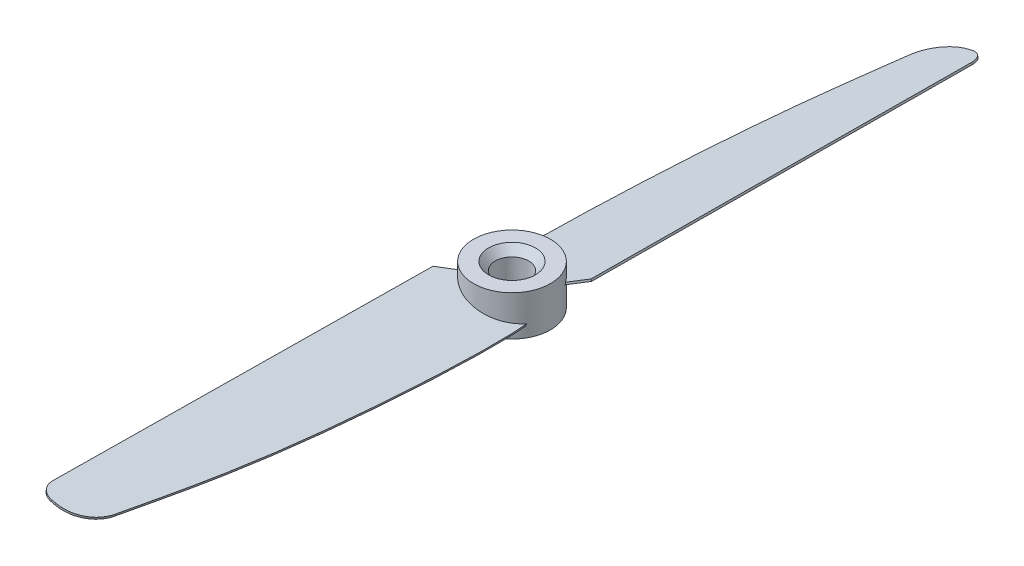
ISO-10303-21;
HEADER;
FILE_DESCRIPTION(('STEP AP214'),'2;1');
FILE_NAME('part.step','',(''),(''),'','','');
FILE_SCHEMA(('AUTOMOTIVE_DESIGN { 1 0 10303 214 1 1 1 1 }'));
ENDSEC;
DATA;
#1=APPLICATION_CONTEXT('core data for automotive mechanical design processes');
#2=APPLICATION_PROTOCOL_DEFINITION('international standard','automotive_design',2000,#1);
#3=PRODUCT_CONTEXT('',#1,'mechanical');
#4=PRODUCT('Part','Part','',(#3));
#5=PRODUCT_RELATED_PRODUCT_CATEGORY('part','',(#4));
#6=PRODUCT_DEFINITION_FORMATION('','',#4);
#7=PRODUCT_DEFINITION_CONTEXT('part definition',#1,'design');
#8=PRODUCT_DEFINITION('design','',#6,#7);
#9=PRODUCT_DEFINITION_SHAPE('','',#8);
#10=(LENGTH_UNIT() NAMED_UNIT(*) SI_UNIT(.MILLI.,.METRE.));
#11=(NAMED_UNIT(*) PLANE_ANGLE_UNIT() SI_UNIT($,.RADIAN.));
#12=(NAMED_UNIT(*) SI_UNIT($,.STERADIAN.) SOLID_ANGLE_UNIT());
#13=UNCERTAINTY_MEASURE_WITH_UNIT(LENGTH_MEASURE(1.E-05),#10,'distance_accuracy_value','');
#14=(GEOMETRIC_REPRESENTATION_CONTEXT(3) GLOBAL_UNCERTAINTY_ASSIGNED_CONTEXT((#13)) GLOBAL_UNIT_ASSIGNED_CONTEXT((#10,
#11,#12)) REPRESENTATION_CONTEXT('',''));
#15=CARTESIAN_POINT('',(0.,0.,0.));
#16=DIRECTION('',(0.,0.,1.));
#17=DIRECTION('',(1.,0.,0.));
#18=AXIS2_PLACEMENT_3D('',#15,#16,#17);
#19=CARTESIAN_POINT('',(0.,3.,0.));
#20=DIRECTION('',(0.,-1.,0.));
#21=DIRECTION('',(0.,0.,-1.));
#22=AXIS2_PLACEMENT_3D('',#19,#20,#21);
#23=CYLINDRICAL_SURFACE('',#22,5.75);
#24=CARTESIAN_POINT('',(-4.95193570611491,-1.45113567137876,-2.92247031849739));
#25=CARTESIAN_POINT('',(-4.961704972205,-1.40198803813977,-2.90592037355739));
#26=CARTESIAN_POINT('',(-4.97143265278503,-1.35287472444937,-2.88924618076763));
#27=CARTESIAN_POINT('',(-4.99080484292502,-1.2547167361658,-2.85564929948861));
#28=CARTESIAN_POINT('',(-5.00044935248497,-1.20567206157261,-2.83872661099934));
#29=CARTESIAN_POINT('',(-5.01005227653487,-1.15666170652803,-2.82167967466032));
#30=B_SPLINE_CURVE_WITH_KNOTS('',3,(#24,#25,#26,#27,#28,#29),.UNSPECIFIED.,.F.,.F.,(4,2,4),(0.,
0.158312875366385,0.31662575073277),.UNSPECIFIED.);
#31=CARTESIAN_POINT('',(-4.95193570611491,-1.45113567137876,-2.92247031849739));
#32=VERTEX_POINT('',#31);
#33=CARTESIAN_POINT('',(-5.01005227653471,-1.15666170652808,-2.82167967466));
#34=VERTEX_POINT('',#33);
#35=EDGE_CURVE('E51',#32,#34,#30,.T.);
#36=ORIENTED_EDGE('',*,*,#35,.F.);
#37=CARTESIAN_POINT('',(0.,-0.307891232338018,0.));
#38=DIRECTION('',(0.224951054343866,-0.974370064785235,0.));
#39=DIRECTION('',(-0.974370064785235,-0.224951054343866,0.));
#40=AXIS2_PLACEMENT_3D('',#37,#38,#39);
#41=ELLIPSE('',#40,5.901248619812,5.75);
#42=CARTESIAN_POINT('',(4.81718823206069,0.804244301109185,-3.13961741887384));
#43=VERTEX_POINT('',#42);
#44=EDGE_CURVE('E55',#32,#43,#41,.T.);
#45=ORIENTED_EDGE('',*,*,#44,.T.);
#46=CARTESIAN_POINT('',(0.,7.08301748882909,0.));
#47=DIRECTION('',(0.673615954099516,0.155516496836276,0.722534542838176));
#48=DIRECTION('',(0.106048656081873,-0.987833295253694,0.113750003654752));
#49=AXIS2_PLACEMENT_3D('',#46,#47,#48);
#50=ELLIPSE('',#49,36.9735694731695,5.75);
#51=CARTESIAN_POINT('',(4.79070517512482,1.10602143799694,-3.17988111806594));
#52=VERTEX_POINT('',#51);
#53=EDGE_CURVE('E248',#43,#52,#50,.T.);
#54=ORIENTED_EDGE('',*,*,#53,.T.);
#55=CARTESIAN_POINT('',(0.,0.,0.));
#56=DIRECTION('',(0.224951054343866,-0.974370064785235,0.));
#57=DIRECTION('',(-0.974370064785235,-0.224951054343866,0.));
#58=AXIS2_PLACEMENT_3D('',#55,#56,#57);
#59=ELLIPSE('',#58,5.901248619812,5.75);
#60=EDGE_CURVE('E349',#34,#52,#59,.T.);
#61=ORIENTED_EDGE('',*,*,#60,.F.);
#62=EDGE_LOOP('',(#36,#45,#54,#61));
#63=FACE_BOUND('',#62,.T.);
#64=CARTESIAN_POINT('',(4.95193570611491,-1.45113567137876,2.92247031849739));
#65=CARTESIAN_POINT('',(4.961704972205,-1.40198803813977,2.90592037355739));
#66=CARTESIAN_POINT('',(4.97143265278503,-1.35287472444937,2.88924618076763));
#67=CARTESIAN_POINT('',(4.99080484292502,-1.2547167361658,2.85564929948861));
#68=CARTESIAN_POINT('',(5.00044935248497,-1.20567206157261,2.83872661099934));
#69=CARTESIAN_POINT('',(5.01005227653487,-1.15666170652803,2.82167967466032));
#70=B_SPLINE_CURVE_WITH_KNOTS('',3,(#64,#65,#66,#67,#68,#69),.UNSPECIFIED.,.F.,.F.,(4,2,4),(0.,
0.158312875366385,0.31662575073277),.UNSPECIFIED.);
#71=CARTESIAN_POINT('',(4.95193570611491,-1.45113567137876,2.92247031849739));
#72=VERTEX_POINT('',#71);
#73=CARTESIAN_POINT('',(5.01005227653471,-1.15666170652808,2.82167967466));
#74=VERTEX_POINT('',#73);
#75=EDGE_CURVE('E223',#72,#74,#70,.T.);
#76=ORIENTED_EDGE('',*,*,#75,.F.);
#77=CARTESIAN_POINT('',(0.,-0.307891232338018,0.));
#78=DIRECTION('',(-0.224951054343866,-0.974370064785235,0.));
#79=DIRECTION('',(0.974370064785235,-0.224951054343866,0.));
#80=AXIS2_PLACEMENT_3D('',#77,#78,#79);
#81=ELLIPSE('',#80,5.901248619812,5.75);
#82=CARTESIAN_POINT('',(-4.81718823206069,0.804244301109185,3.13961741887384));
#83=VERTEX_POINT('',#82);
#84=EDGE_CURVE('E232',#72,#83,#81,.T.);
#85=ORIENTED_EDGE('',*,*,#84,.T.);
#86=CARTESIAN_POINT('',(0.,7.08301748882909,0.));
#87=DIRECTION('',(-0.673615954099516,0.155516496836276,-0.722534542838176));
#88=DIRECTION('',(-0.106048656081873,-0.987833295253694,-0.113750003654752));
#89=AXIS2_PLACEMENT_3D('',#86,#87,#88);
#90=ELLIPSE('',#89,36.9735694731695,5.75);
#91=CARTESIAN_POINT('',(-4.79070517512482,1.10602143799694,3.17988111806594));
#92=VERTEX_POINT('',#91);
#93=EDGE_CURVE('E233',#83,#92,#90,.T.);
#94=ORIENTED_EDGE('',*,*,#93,.T.);
#95=CARTESIAN_POINT('',(0.,0.,0.));
#96=DIRECTION('',(-0.224951054343866,-0.974370064785235,0.));
#97=DIRECTION('',(0.974370064785235,-0.224951054343866,0.));
#98=AXIS2_PLACEMENT_3D('',#95,#96,#97);
#99=ELLIPSE('',#98,5.901248619812,5.75);
#100=EDGE_CURVE('E320',#74,#92,#99,.T.);
#101=ORIENTED_EDGE('',*,*,#100,.F.);
#102=EDGE_LOOP('',(#76,#85,#94,#101));
#103=FACE_BOUND('',#102,.T.);
#104=CARTESIAN_POINT('',(0.,3.,0.));
#105=DIRECTION('',(0.,1.,0.));
#106=DIRECTION('',(0.,0.,1.));
#107=AXIS2_PLACEMENT_3D('',#104,#105,#106);
#108=CIRCLE('',#107,5.75);
#109=CARTESIAN_POINT('',(0.,3.,5.75));
#110=VERTEX_POINT('',#109);
#111=EDGE_CURVE('E317',#110,#110,#108,.T.);
#112=ORIENTED_EDGE('',*,*,#111,.F.);
#113=EDGE_LOOP('',(#112));
#114=FACE_BOUND('',#113,.T.);
#115=CARTESIAN_POINT('',(0.,-3.,0.));
#116=DIRECTION('',(0.,1.,0.));
#117=DIRECTION('',(0.,0.,1.));
#118=AXIS2_PLACEMENT_3D('',#115,#116,#117);
#119=CIRCLE('',#118,5.75);
#120=CARTESIAN_POINT('',(0.,-3.,5.75));
#121=VERTEX_POINT('',#120);
#122=EDGE_CURVE('E316',#121,#121,#119,.T.);
#123=ORIENTED_EDGE('',*,*,#122,.T.);
#124=EDGE_LOOP('',(#123));
#125=FACE_BOUND('',#124,.T.);
#126=ADVANCED_FACE('F36',(#63,#103,#114,#125),#23,.T.);
#127=CARTESIAN_POINT('',(0.,3.,0.));
#128=DIRECTION('',(0.,1.,0.));
#129=DIRECTION('',(0.,0.,1.));
#130=AXIS2_PLACEMENT_3D('',#127,#128,#129);
#131=PLANE('',#130);
#132=CARTESIAN_POINT('',(0.,3.,0.));
#133=DIRECTION('',(0.,1.,0.));
#134=DIRECTION('',(0.,0.,1.));
#135=AXIS2_PLACEMENT_3D('',#132,#133,#134);
#136=CIRCLE('',#135,3.49999999999998);
#137=CARTESIAN_POINT('',(0.,3.,3.49999999999998));
#138=VERTEX_POINT('',#137);
#139=EDGE_CURVE('E11',#138,#138,#136,.F.);
#140=ORIENTED_EDGE('',*,*,#139,.T.);
#141=EDGE_LOOP('',(#140));
#142=FACE_BOUND('',#141,.T.);
#143=ORIENTED_EDGE('',*,*,#111,.T.);
#144=EDGE_LOOP('',(#143));
#145=FACE_BOUND('',#144,.T.);
#146=ADVANCED_FACE('F220',(#142,#145),#131,.T.);
#147=CARTESIAN_POINT('',(0.,-3.,0.));
#148=DIRECTION('',(0.,1.,0.));
#149=DIRECTION('',(0.,0.,1.));
#150=AXIS2_PLACEMENT_3D('',#147,#148,#149);
#151=PLANE('',#150);
#152=CARTESIAN_POINT('',(0.,-3.,0.));
#153=DIRECTION('',(0.,1.,0.));
#154=DIRECTION('',(0.,0.,1.));
#155=AXIS2_PLACEMENT_3D('',#152,#153,#154);
#156=CIRCLE('',#155,3.50000000000002);
#157=CARTESIAN_POINT('',(0.,-3.,3.50000000000002));
#158=VERTEX_POINT('',#157);
#159=EDGE_CURVE('E44',#158,#158,#156,.T.);
#160=ORIENTED_EDGE('',*,*,#159,.T.);
#161=EDGE_LOOP('',(#160));
#162=FACE_BOUND('',#161,.T.);
#163=ORIENTED_EDGE('',*,*,#122,.F.);
#164=EDGE_LOOP('',(#163));
#165=FACE_BOUND('',#164,.T.);
#166=ADVANCED_FACE('F217',(#162,#165),#151,.F.);
#167=CARTESIAN_POINT('',(4.91458748879725,-1.44251315600496,2.54941026175262));
#168=CARTESIAN_POINT('',(5.52114881383232,-1.58254887192254,8.02895392356261));
#169=CARTESIAN_POINT('',(4.16746482793332,-1.27002629874239,38.9767406595812));
#170=CARTESIAN_POINT('',(0.305828711526689,-0.378497353762444,57.2051243055643));
#171=CARTESIAN_POINT('',(0.0109761407232928,-0.310425274092345,59.2366526259097));
#172=B_SPLINE_CURVE_WITH_KNOTS('',3,(#167,#168,#169,#170,#171),.UNSPECIFIED.,.F.,.F.,(4,1,4),
(0.,0.552499719833316,0.930981026797069),.UNSPECIFIED.);
#173=DIRECTION('',(0.224951054343866,0.974370064785235,0.));
#174=VECTOR('',#173,1.);
#175=SURFACE_OF_LINEAR_EXTRUSION('',#172,#174);
#176=CARTESIAN_POINT('',(0.0109761407232971,-0.310425274092352,59.2366526259097));
#177=VERTEX_POINT('',#176);
#178=EDGE_CURVE('E199',#72,#177,#172,.T.);
#179=ORIENTED_EDGE('',*,*,#178,.F.);
#180=ORIENTED_EDGE('',*,*,#75,.T.);
#181=CARTESIAN_POINT('',(4.98207280510041,-1.15020213656939,2.54941026175262));
#182=CARTESIAN_POINT('',(5.58863413013548,-1.29023785248697,8.02895392356261));
#183=CARTESIAN_POINT('',(4.23495014423648,-0.977715279306821,38.9767406595812));
#184=CARTESIAN_POINT('',(0.373314027829848,-0.0861863343268737,57.2051243055643));
#185=CARTESIAN_POINT('',(0.0784614570264524,-0.0181142546567745,59.2366526259097));
#186=B_SPLINE_CURVE_WITH_KNOTS('',3,(#181,#182,#183,#184,#185),.UNSPECIFIED.,.F.,.F.,(4,1,4),
(0.,0.552499719833316,0.930981026797069),.UNSPECIFIED.);
#187=CARTESIAN_POINT('',(0.0784614570264568,-0.0181142546567814,59.2366526259097));
#188=VERTEX_POINT('',#187);
#189=EDGE_CURVE('E153',#74,#188,#186,.T.);
#190=ORIENTED_EDGE('',*,*,#189,.T.);
#191=DIRECTION('',(0.224951054343866,0.974370064785235,0.));
#192=VECTOR('',#191,1.);
#193=CARTESIAN_POINT('',(0.0109761407232971,-0.310425274092352,59.2366526259097));
#194=LINE('',#193,#192);
#195=EDGE_CURVE('E313',#177,#188,#194,.T.);
#196=ORIENTED_EDGE('',*,*,#195,.F.);
#197=EDGE_LOOP('',(#179,#180,#190,#196));
#198=FACE_BOUND('',#197,.T.);
#199=ADVANCED_FACE('F211',(#198),#175,.F.);
#200=CARTESIAN_POINT('',(-4.8077092144028,0.802055897448858,58.5));
#201=DIRECTION('',(0.224951054343866,0.974370064785235,0.));
#202=DIRECTION('',(-0.974370064785235,0.224951054343866,0.));
#203=AXIS2_PLACEMENT_3D('',#200,#201,#202);
#204=CYLINDRICAL_SURFACE('',#203,5.);
#205=CARTESIAN_POINT('',(-4.74022389809964,1.09436691688443,58.5));
#206=DIRECTION('',(-0.224951054343866,-0.974370064785235,0.));
#207=DIRECTION('',(0.974370064785235,-0.224951054343866,0.));
#208=AXIS2_PLACEMENT_3D('',#205,#206,#207);
#209=CIRCLE('',#208,5.);
#210=CARTESIAN_POINT('',(-4.74022389809964,1.09436691688443,63.5));
#211=VERTEX_POINT('',#210);
#212=EDGE_CURVE('E293',#188,#211,#209,.T.);
#213=ORIENTED_EDGE('',*,*,#212,.T.);
#214=DIRECTION('',(0.224951054343866,0.974370064785235,0.));
#215=VECTOR('',#214,1.);
#216=CARTESIAN_POINT('',(-4.8077092144028,0.802055897448861,63.5));
#217=LINE('',#216,#215);
#218=CARTESIAN_POINT('',(-4.8077092144028,0.802055897448861,63.5));
#219=VERTEX_POINT('',#218);
#220=EDGE_CURVE('E289',#219,#211,#217,.T.);
#221=ORIENTED_EDGE('',*,*,#220,.F.);
#222=CARTESIAN_POINT('',(-4.8077092144028,0.802055897448858,58.5));
#223=DIRECTION('',(-0.224951054343866,-0.974370064785235,0.));
#224=DIRECTION('',(0.974370064785235,-0.224951054343866,0.));
#225=AXIS2_PLACEMENT_3D('',#222,#223,#224);
#226=CIRCLE('',#225,5.);
#227=EDGE_CURVE('E204',#177,#219,#226,.T.);
#228=ORIENTED_EDGE('',*,*,#227,.F.);
#229=ORIENTED_EDGE('',*,*,#195,.T.);
#230=EDGE_LOOP('',(#213,#221,#228,#229));
#231=FACE_BOUND('',#230,.T.);
#232=ADVANCED_FACE('F216',(#231),#204,.T.);
#233=CARTESIAN_POINT('',(-0.0674853163031603,-0.292311019435573,63.5));
#234=DIRECTION('',(0.,0.,1.));
#235=DIRECTION('',(1.,0.,0.));
#236=AXIS2_PLACEMENT_3D('',#233,#234,#235);
#237=PLANE('',#236);
#238=DIRECTION('',(0.974370064785235,-0.224951054343866,0.));
#239=VECTOR('',#238,1.);
#240=CARTESIAN_POINT('',(0.,0.,63.5));
#241=LINE('',#240,#239);
#242=CARTESIAN_POINT('',(-5.31345120671838,1.22670686872901,63.5));
#243=VERTEX_POINT('',#242);
#244=EDGE_CURVE('E283',#243,#211,#241,.T.);
#245=ORIENTED_EDGE('',*,*,#244,.F.);
#246=DIRECTION('',(0.224951054343866,0.974370064785235,0.));
#247=VECTOR('',#246,1.);
#248=CARTESIAN_POINT('',(-5.38093652302154,0.934395849293442,63.5));
#249=LINE('',#248,#247);
#250=CARTESIAN_POINT('',(-5.38093652302154,0.934395849293442,63.5));
#251=VERTEX_POINT('',#250);
#252=EDGE_CURVE('E286',#251,#243,#249,.T.);
#253=ORIENTED_EDGE('',*,*,#252,.F.);
#254=DIRECTION('',(0.974370064785235,-0.224951054343866,0.));
#255=VECTOR('',#254,1.);
#256=CARTESIAN_POINT('',(-0.0674853163031603,-0.292311019435573,63.5));
#257=LINE('',#256,#255);
#258=EDGE_CURVE('E347',#251,#219,#257,.T.);
#259=ORIENTED_EDGE('',*,*,#258,.T.);
#260=ORIENTED_EDGE('',*,*,#220,.T.);
#261=EDGE_LOOP('',(#245,#253,#259,#260));
#262=FACE_BOUND('',#261,.T.);
#263=ADVANCED_FACE('F273',(#262),#237,.T.);
#264=CARTESIAN_POINT('',(-5.38093652302155,0.934395849293443,61.5));
#265=DIRECTION('',(0.224951054343866,0.974370064785235,0.));
#266=DIRECTION('',(-0.974370064785235,0.224951054343866,0.));
#267=AXIS2_PLACEMENT_3D('',#264,#265,#266);
#268=CYLINDRICAL_SURFACE('',#267,2.);
#269=CARTESIAN_POINT('',(-5.31345120671839,1.22670686872901,61.5));
#270=DIRECTION('',(-0.224951054343866,-0.974370064785235,0.));
#271=DIRECTION('',(0.974370064785235,-0.224951054343866,0.));
#272=AXIS2_PLACEMENT_3D('',#269,#270,#271);
#273=CIRCLE('',#272,2.);
#274=CARTESIAN_POINT('',(-7.26209971212116,1.67658782431089,61.4806059752429));
#275=VERTEX_POINT('',#274);
#276=EDGE_CURVE('E292',#275,#243,#273,.F.);
#277=ORIENTED_EDGE('',*,*,#276,.F.);
#278=DIRECTION('',(0.224951054343866,0.974370064785235,0.));
#279=VECTOR('',#278,1.);
#280=CARTESIAN_POINT('',(-7.32958502842432,1.38427680487532,61.4806059752429));
#281=LINE('',#280,#279);
#282=CARTESIAN_POINT('',(-7.32958502842432,1.38427680487532,61.4806059752429));
#283=VERTEX_POINT('',#282);
#284=EDGE_CURVE('E308',#283,#275,#281,.T.);
#285=ORIENTED_EDGE('',*,*,#284,.F.);
#286=CARTESIAN_POINT('',(-5.38093652302155,0.934395849293443,61.5));
#287=DIRECTION('',(-0.224951054343866,-0.974370064785235,0.));
#288=DIRECTION('',(0.974370064785235,-0.224951054343866,0.));
#289=AXIS2_PLACEMENT_3D('',#286,#287,#288);
#290=CIRCLE('',#289,2.);
#291=EDGE_CURVE('E336',#283,#251,#290,.F.);
#292=ORIENTED_EDGE('',*,*,#291,.T.);
#293=ORIENTED_EDGE('',*,*,#252,.T.);
#294=EDGE_LOOP('',(#277,#285,#292,#293));
#295=FACE_BOUND('',#294,.T.);
#296=ADVANCED_FACE('F270',(#295),#268,.T.);
#297=CARTESIAN_POINT('',(-6.74803128186024,1.25001454336377,-0.0664884782904139));
#298=DIRECTION('',(-0.974324252701387,0.224940477790936,-0.00969701237856207));
#299=DIRECTION('',(-0.224951054343866,-0.974370064785235,0.));
#300=AXIS2_PLACEMENT_3D('',#297,#298,#299);
#301=PLANE('',#300);
#302=DIRECTION('',(-0.00944847857952276,0.00218135315854301,0.99995298287016));
#303=VECTOR('',#302,1.);
#304=CARTESIAN_POINT('',(-6.68054596555708,1.54232556279934,-0.0664884782904139));
#305=LINE('',#304,#303);
#306=CARTESIAN_POINT('',(-6.72920748641697,1.55355996009769,5.08346582655457));
#307=VERTEX_POINT('',#306);
#308=EDGE_CURVE('E299',#307,#275,#305,.T.);
#309=ORIENTED_EDGE('',*,*,#308,.F.);
#310=DIRECTION('',(0.224951054343866,0.974370064785235,0.));
#311=VECTOR('',#310,1.);
#312=CARTESIAN_POINT('',(-6.79669280272013,1.26124894066212,5.08346582655457));
#313=LINE('',#312,#311);
#314=CARTESIAN_POINT('',(-6.79669280272013,1.26124894066212,5.08346582655457));
#315=VERTEX_POINT('',#314);
#316=EDGE_CURVE('E305',#315,#307,#313,.T.);
#317=ORIENTED_EDGE('',*,*,#316,.F.);
#318=DIRECTION('',(-0.00944847857952276,0.00218135315854301,0.99995298287016));
#319=VECTOR('',#318,1.);
#320=CARTESIAN_POINT('',(-6.74803128186024,1.25001454336377,-0.0664884782904139));
#321=LINE('',#320,#319);
#322=EDGE_CURVE('E334',#315,#283,#321,.T.);
#323=ORIENTED_EDGE('',*,*,#322,.T.);
#324=ORIENTED_EDGE('',*,*,#284,.T.);
#325=EDGE_LOOP('',(#309,#317,#323,#324));
#326=FACE_BOUND('',#325,.T.);
#327=ADVANCED_FACE('F266',(#326),#301,.T.);
#328=CARTESIAN_POINT('',(-0.809490848818624,-0.121005544338565,-0.795890633166705));
#329=DIRECTION('',(-0.673615954099516,0.155516496836276,-0.722534542838176));
#330=DIRECTION('',(-0.731433680469957,0.,0.681912583161634));
#331=AXIS2_PLACEMENT_3D('',#328,#329,#330);
#332=PLANE('',#331);
#333=ORIENTED_EDGE('',*,*,#93,.F.);
#334=DIRECTION('',(-0.704016029314803,0.16253490721131,0.691334820767498));
#335=VECTOR('',#334,1.);
#336=CARTESIAN_POINT('',(-0.809490848818624,-0.121005544338565,-0.795890633166705));
#337=LINE('',#336,#335);
#338=EDGE_CURVE('E309',#83,#315,#337,.T.);
#339=ORIENTED_EDGE('',*,*,#338,.T.);
#340=ORIENTED_EDGE('',*,*,#316,.T.);
#341=DIRECTION('',(-0.704016029314803,0.16253490721131,0.691334820767498));
#342=VECTOR('',#341,1.);
#343=CARTESIAN_POINT('',(-0.742005532515465,0.171305475097006,-0.795890633166705));
#344=LINE('',#343,#342);
#345=EDGE_CURVE('E205',#92,#307,#344,.T.);
#346=ORIENTED_EDGE('',*,*,#345,.F.);
#347=EDGE_LOOP('',(#333,#339,#340,#346));
#348=FACE_BOUND('',#347,.T.);
#349=ADVANCED_FACE('F259',(#348),#332,.T.);
#350=CARTESIAN_POINT('',(-0.0674853163031597,-0.292311019435571,0.));
#351=DIRECTION('',(-0.224951054343866,-0.974370064785235,0.));
#352=DIRECTION('',(0.974370064785235,-0.224951054343866,0.));
#353=AXIS2_PLACEMENT_3D('',#350,#351,#352);
#354=PLANE('',#353);
#355=ORIENTED_EDGE('',*,*,#84,.F.);
#356=ORIENTED_EDGE('',*,*,#178,.T.);
#357=ORIENTED_EDGE('',*,*,#227,.T.);
#358=ORIENTED_EDGE('',*,*,#258,.F.);
#359=ORIENTED_EDGE('',*,*,#291,.F.);
#360=ORIENTED_EDGE('',*,*,#322,.F.);
#361=ORIENTED_EDGE('',*,*,#338,.F.);
#362=EDGE_LOOP('',(#355,#356,#357,#358,#359,#360,#361));
#363=FACE_BOUND('',#362,.T.);
#364=ADVANCED_FACE('F256',(#363),#354,.T.);
#365=CARTESIAN_POINT('',(0.,0.,0.));
#366=DIRECTION('',(-0.224951054343866,-0.974370064785235,0.));
#367=DIRECTION('',(0.974370064785235,-0.224951054343866,0.));
#368=AXIS2_PLACEMENT_3D('',#365,#366,#367);
#369=PLANE('',#368);
#370=ORIENTED_EDGE('',*,*,#189,.F.);
#371=ORIENTED_EDGE('',*,*,#100,.T.);
#372=ORIENTED_EDGE('',*,*,#345,.T.);
#373=ORIENTED_EDGE('',*,*,#308,.T.);
#374=ORIENTED_EDGE('',*,*,#276,.T.);
#375=ORIENTED_EDGE('',*,*,#244,.T.);
#376=ORIENTED_EDGE('',*,*,#212,.F.);
#377=EDGE_LOOP('',(#370,#371,#372,#373,#374,#375,#376));
#378=FACE_BOUND('',#377,.T.);
#379=ADVANCED_FACE('F254',(#378),#369,.F.);
#380=CARTESIAN_POINT('',(-4.91458748879725,-1.44251315600496,-2.54941026175262));
#381=CARTESIAN_POINT('',(-5.52114881383232,-1.58254887192254,-8.02895392356261));
#382=CARTESIAN_POINT('',(-4.16746482793332,-1.27002629874239,-38.9767406595812));
#383=CARTESIAN_POINT('',(-0.305828711526689,-0.378497353762444,-57.2051243055643));
#384=CARTESIAN_POINT('',(-0.0109761407232928,-0.310425274092345,-59.2366526259097));
#385=B_SPLINE_CURVE_WITH_KNOTS('',3,(#380,#381,#382,#383,#384),.UNSPECIFIED.,.F.,.F.,(4,1,4),
(0.,0.552499719833316,0.930981026797069),.UNSPECIFIED.);
#386=DIRECTION('',(-0.224951054343866,0.974370064785235,0.));
#387=VECTOR('',#386,1.);
#388=SURFACE_OF_LINEAR_EXTRUSION('',#385,#387);
#389=CARTESIAN_POINT('',(-0.0109761407232971,-0.310425274092352,-59.2366526259097));
#390=VERTEX_POINT('',#389);
#391=EDGE_CURVE('E134',#32,#390,#385,.T.);
#392=ORIENTED_EDGE('',*,*,#391,.F.);
#393=ORIENTED_EDGE('',*,*,#35,.T.);
#394=CARTESIAN_POINT('',(-4.98207280510041,-1.15020213656939,-2.54941026175262));
#395=CARTESIAN_POINT('',(-5.58863413013548,-1.29023785248697,-8.02895392356261));
#396=CARTESIAN_POINT('',(-4.23495014423648,-0.977715279306821,-38.9767406595812));
#397=CARTESIAN_POINT('',(-0.373314027829848,-0.0861863343268737,-57.2051243055643));
#398=CARTESIAN_POINT('',(-0.0784614570264524,-0.0181142546567745,-59.2366526259097));
#399=B_SPLINE_CURVE_WITH_KNOTS('',3,(#394,#395,#396,#397,#398),.UNSPECIFIED.,.F.,.F.,(4,1,4),
(0.,0.552499719833316,0.930981026797069),.UNSPECIFIED.);
#400=CARTESIAN_POINT('',(-0.0784614570264568,-0.0181142546567814,-59.2366526259097));
#401=VERTEX_POINT('',#400);
#402=EDGE_CURVE('E149',#34,#401,#399,.T.);
#403=ORIENTED_EDGE('',*,*,#402,.T.);
#404=DIRECTION('',(-0.224951054343866,0.974370064785235,0.));
#405=VECTOR('',#404,1.);
#406=CARTESIAN_POINT('',(-0.0109761407232971,-0.310425274092352,-59.2366526259097));
#407=LINE('',#406,#405);
#408=EDGE_CURVE('E146',#390,#401,#407,.T.);
#409=ORIENTED_EDGE('',*,*,#408,.F.);
#410=EDGE_LOOP('',(#392,#393,#403,#409));
#411=FACE_BOUND('',#410,.T.);
#412=ADVANCED_FACE('F147',(#411),#388,.F.);
#413=CARTESIAN_POINT('',(4.8077092144028,0.802055897448858,-58.5));
#414=DIRECTION('',(-0.224951054343866,0.974370064785235,0.));
#415=DIRECTION('',(-0.974370064785235,-0.224951054343866,0.));
#416=AXIS2_PLACEMENT_3D('',#413,#414,#415);
#417=CYLINDRICAL_SURFACE('',#416,5.);
#418=CARTESIAN_POINT('',(4.74022389809964,1.09436691688443,-58.5));
#419=DIRECTION('',(0.224951054343866,-0.974370064785235,0.));
#420=DIRECTION('',(-0.974370064785235,-0.224951054343866,0.));
#421=AXIS2_PLACEMENT_3D('',#418,#419,#420);
#422=CIRCLE('',#421,5.);
#423=CARTESIAN_POINT('',(4.74022389809964,1.09436691688443,-63.5));
#424=VERTEX_POINT('',#423);
#425=EDGE_CURVE('E177',#401,#424,#422,.T.);
#426=ORIENTED_EDGE('',*,*,#425,.T.);
#427=DIRECTION('',(-0.224951054343866,0.974370064785235,0.));
#428=VECTOR('',#427,1.);
#429=CARTESIAN_POINT('',(4.8077092144028,0.802055897448861,-63.5));
#430=LINE('',#429,#428);
#431=CARTESIAN_POINT('',(4.8077092144028,0.802055897448861,-63.5));
#432=VERTEX_POINT('',#431);
#433=EDGE_CURVE('E154',#432,#424,#430,.T.);
#434=ORIENTED_EDGE('',*,*,#433,.F.);
#435=CARTESIAN_POINT('',(4.8077092144028,0.802055897448858,-58.5));
#436=DIRECTION('',(0.224951054343866,-0.974370064785235,0.));
#437=DIRECTION('',(-0.974370064785235,-0.224951054343866,0.));
#438=AXIS2_PLACEMENT_3D('',#435,#436,#437);
#439=CIRCLE('',#438,5.);
#440=EDGE_CURVE('E139',#390,#432,#439,.T.);
#441=ORIENTED_EDGE('',*,*,#440,.F.);
#442=ORIENTED_EDGE('',*,*,#408,.T.);
#443=EDGE_LOOP('',(#426,#434,#441,#442));
#444=FACE_BOUND('',#443,.T.);
#445=ADVANCED_FACE('F156',(#444),#417,.T.);
#446=CARTESIAN_POINT('',(0.0674853163031603,-0.292311019435573,-63.5));
#447=DIRECTION('',(0.,0.,-1.));
#448=DIRECTION('',(-1.,0.,0.));
#449=AXIS2_PLACEMENT_3D('',#446,#447,#448);
#450=PLANE('',#449);
#451=DIRECTION('',(-0.974370064785235,-0.224951054343866,0.));
#452=VECTOR('',#451,1.);
#453=CARTESIAN_POINT('',(0.,0.,-63.5));
#454=LINE('',#453,#452);
#455=CARTESIAN_POINT('',(5.31345120671838,1.22670686872901,-63.5));
#456=VERTEX_POINT('',#455);
#457=EDGE_CURVE('E182',#456,#424,#454,.T.);
#458=ORIENTED_EDGE('',*,*,#457,.F.);
#459=DIRECTION('',(-0.224951054343866,0.974370064785235,0.));
#460=VECTOR('',#459,1.);
#461=CARTESIAN_POINT('',(5.38093652302154,0.934395849293442,-63.5));
#462=LINE('',#461,#460);
#463=CARTESIAN_POINT('',(5.38093652302154,0.934395849293442,-63.5));
#464=VERTEX_POINT('',#463);
#465=EDGE_CURVE('E196',#464,#456,#462,.T.);
#466=ORIENTED_EDGE('',*,*,#465,.F.);
#467=DIRECTION('',(-0.974370064785235,-0.224951054343866,0.));
#468=VECTOR('',#467,1.);
#469=CARTESIAN_POINT('',(0.0674853163031603,-0.292311019435573,-63.5));
#470=LINE('',#469,#468);
#471=EDGE_CURVE('E158',#464,#432,#470,.T.);
#472=ORIENTED_EDGE('',*,*,#471,.T.);
#473=ORIENTED_EDGE('',*,*,#433,.T.);
#474=EDGE_LOOP('',(#458,#466,#472,#473));
#475=FACE_BOUND('',#474,.T.);
#476=ADVANCED_FACE('F367',(#475),#450,.T.);
#477=CARTESIAN_POINT('',(5.38093652302155,0.934395849293443,-61.5));
#478=DIRECTION('',(-0.224951054343866,0.974370064785235,0.));
#479=DIRECTION('',(-0.974370064785235,-0.224951054343866,0.));
#480=AXIS2_PLACEMENT_3D('',#477,#478,#479);
#481=CYLINDRICAL_SURFACE('',#480,2.);
#482=CARTESIAN_POINT('',(5.31345120671839,1.22670686872901,-61.5));
#483=DIRECTION('',(0.224951054343866,-0.974370064785235,0.));
#484=DIRECTION('',(-0.974370064785235,-0.224951054343866,0.));
#485=AXIS2_PLACEMENT_3D('',#482,#483,#484);
#486=CIRCLE('',#485,2.);
#487=CARTESIAN_POINT('',(7.26209971212116,1.67658782431089,-61.4806059752429));
#488=VERTEX_POINT('',#487);
#489=EDGE_CURVE('E185',#488,#456,#486,.F.);
#490=ORIENTED_EDGE('',*,*,#489,.F.);
#491=DIRECTION('',(-0.224951054343866,0.974370064785235,0.));
#492=VECTOR('',#491,1.);
#493=CARTESIAN_POINT('',(7.32958502842432,1.38427680487532,-61.4806059752429));
#494=LINE('',#493,#492);
#495=CARTESIAN_POINT('',(7.32958502842432,1.38427680487532,-61.4806059752429));
#496=VERTEX_POINT('',#495);
#497=EDGE_CURVE('E194',#496,#488,#494,.T.);
#498=ORIENTED_EDGE('',*,*,#497,.F.);
#499=CARTESIAN_POINT('',(5.38093652302155,0.934395849293443,-61.5));
#500=DIRECTION('',(0.224951054343866,-0.974370064785235,0.));
#501=DIRECTION('',(-0.974370064785235,-0.224951054343866,0.));
#502=AXIS2_PLACEMENT_3D('',#499,#500,#501);
#503=CIRCLE('',#502,2.);
#504=EDGE_CURVE('E160',#496,#464,#503,.F.);
#505=ORIENTED_EDGE('',*,*,#504,.T.);
#506=ORIENTED_EDGE('',*,*,#465,.T.);
#507=EDGE_LOOP('',(#490,#498,#505,#506));
#508=FACE_BOUND('',#507,.T.);
#509=ADVANCED_FACE('F365',(#508),#481,.T.);
#510=CARTESIAN_POINT('',(6.74803128186024,1.25001454336377,0.0664884782904139));
#511=DIRECTION('',(0.974324252701387,0.224940477790936,0.00969701237856207));
#512=DIRECTION('',(-0.224951054343866,0.974370064785235,0.));
#513=AXIS2_PLACEMENT_3D('',#510,#511,#512);
#514=PLANE('',#513);
#515=DIRECTION('',(0.00944847857952276,0.00218135315854301,-0.99995298287016));
#516=VECTOR('',#515,1.);
#517=CARTESIAN_POINT('',(6.68054596555708,1.54232556279934,0.0664884782904139));
#518=LINE('',#517,#516);
#519=CARTESIAN_POINT('',(6.72920748641697,1.55355996009769,-5.08346582655457));
#520=VERTEX_POINT('',#519);
#521=EDGE_CURVE('E188',#520,#488,#518,.T.);
#522=ORIENTED_EDGE('',*,*,#521,.F.);
#523=DIRECTION('',(-0.224951054343866,0.974370064785235,0.));
#524=VECTOR('',#523,1.);
#525=CARTESIAN_POINT('',(6.79669280272013,1.26124894066212,-5.08346582655457));
#526=LINE('',#525,#524);
#527=CARTESIAN_POINT('',(6.79669280272013,1.26124894066212,-5.08346582655457));
#528=VERTEX_POINT('',#527);
#529=EDGE_CURVE('E173',#528,#520,#526,.T.);
#530=ORIENTED_EDGE('',*,*,#529,.F.);
#531=DIRECTION('',(0.00944847857952276,0.00218135315854301,-0.99995298287016));
#532=VECTOR('',#531,1.);
#533=CARTESIAN_POINT('',(6.74803128186024,1.25001454336377,0.0664884782904139));
#534=LINE('',#533,#532);
#535=EDGE_CURVE('E168',#528,#496,#534,.T.);
#536=ORIENTED_EDGE('',*,*,#535,.T.);
#537=ORIENTED_EDGE('',*,*,#497,.T.);
#538=EDGE_LOOP('',(#522,#530,#536,#537));
#539=FACE_BOUND('',#538,.T.);
#540=ADVANCED_FACE('F360',(#539),#514,.T.);
#541=CARTESIAN_POINT('',(0.809490848818624,-0.121005544338565,0.795890633166705));
#542=DIRECTION('',(0.673615954099516,0.155516496836276,0.722534542838176));
#543=DIRECTION('',(0.731433680469957,0.,-0.681912583161634));
#544=AXIS2_PLACEMENT_3D('',#541,#542,#543);
#545=PLANE('',#544);
#546=ORIENTED_EDGE('',*,*,#53,.F.);
#547=DIRECTION('',(0.704016029314803,0.16253490721131,-0.691334820767498));
#548=VECTOR('',#547,1.);
#549=CARTESIAN_POINT('',(0.809490848818624,-0.121005544338565,0.795890633166705));
#550=LINE('',#549,#548);
#551=EDGE_CURVE('E171',#43,#528,#550,.T.);
#552=ORIENTED_EDGE('',*,*,#551,.T.);
#553=ORIENTED_EDGE('',*,*,#529,.T.);
#554=DIRECTION('',(0.704016029314803,0.16253490721131,-0.691334820767498));
#555=VECTOR('',#554,1.);
#556=CARTESIAN_POINT('',(0.742005532515465,0.171305475097006,0.795890633166705));
#557=LINE('',#556,#555);
#558=EDGE_CURVE('E143',#52,#520,#557,.T.);
#559=ORIENTED_EDGE('',*,*,#558,.F.);
#560=EDGE_LOOP('',(#546,#552,#553,#559));
#561=FACE_BOUND('',#560,.T.);
#562=ADVANCED_FACE('F354',(#561),#545,.T.);
#563=CARTESIAN_POINT('',(0.0674853163031597,-0.292311019435571,0.));
#564=DIRECTION('',(0.224951054343866,-0.974370064785235,0.));
#565=DIRECTION('',(-0.974370064785235,-0.224951054343866,0.));
#566=AXIS2_PLACEMENT_3D('',#563,#564,#565);
#567=PLANE('',#566);
#568=ORIENTED_EDGE('',*,*,#44,.F.);
#569=ORIENTED_EDGE('',*,*,#391,.T.);
#570=ORIENTED_EDGE('',*,*,#440,.T.);
#571=ORIENTED_EDGE('',*,*,#471,.F.);
#572=ORIENTED_EDGE('',*,*,#504,.F.);
#573=ORIENTED_EDGE('',*,*,#535,.F.);
#574=ORIENTED_EDGE('',*,*,#551,.F.);
#575=EDGE_LOOP('',(#568,#569,#570,#571,#572,#573,#574));
#576=FACE_BOUND('',#575,.T.);
#577=ADVANCED_FACE('F136',(#576),#567,.T.);
#578=CARTESIAN_POINT('',(0.,0.,0.));
#579=DIRECTION('',(0.224951054343866,-0.974370064785235,0.));
#580=DIRECTION('',(-0.974370064785235,-0.224951054343866,0.));
#581=AXIS2_PLACEMENT_3D('',#578,#579,#580);
#582=PLANE('',#581);
#583=ORIENTED_EDGE('',*,*,#402,.F.);
#584=ORIENTED_EDGE('',*,*,#60,.T.);
#585=ORIENTED_EDGE('',*,*,#558,.T.);
#586=ORIENTED_EDGE('',*,*,#521,.T.);
#587=ORIENTED_EDGE('',*,*,#489,.T.);
#588=ORIENTED_EDGE('',*,*,#457,.T.);
#589=ORIENTED_EDGE('',*,*,#425,.F.);
#590=EDGE_LOOP('',(#583,#584,#585,#586,#587,#588,#589));
#591=FACE_BOUND('',#590,.T.);
#592=ADVANCED_FACE('F362',(#591),#582,.F.);
#593=CARTESIAN_POINT('',(0.,13.3,0.));
#594=DIRECTION('',(0.,-1.,0.));
#595=DIRECTION('',(0.,0.,-1.));
#596=AXIS2_PLACEMENT_3D('',#593,#594,#595);
#597=CYLINDRICAL_SURFACE('',#596,2.5);
#598=CARTESIAN_POINT('',(0.,-1.80824640740578,0.));
#599=DIRECTION('',(0.,1.,0.));
#600=DIRECTION('',(0.,0.,1.));
#601=AXIS2_PLACEMENT_3D('',#598,#599,#600);
#602=CIRCLE('',#601,2.5);
#603=CARTESIAN_POINT('',(0.,-1.80824640740578,2.5));
#604=VERTEX_POINT('',#603);
#605=EDGE_CURVE('E393',#604,#604,#602,.F.);
#606=ORIENTED_EDGE('',*,*,#605,.T.);
#607=EDGE_LOOP('',(#606));
#608=FACE_BOUND('',#607,.T.);
#609=CARTESIAN_POINT('',(0.,1.80824640740582,0.));
#610=DIRECTION('',(0.,1.,0.));
#611=DIRECTION('',(0.,0.,1.));
#612=AXIS2_PLACEMENT_3D('',#609,#610,#611);
#613=CIRCLE('',#612,2.5);
#614=CARTESIAN_POINT('',(0.,1.80824640740582,2.5));
#615=VERTEX_POINT('',#614);
#616=EDGE_CURVE('E396',#615,#615,#613,.T.);
#617=ORIENTED_EDGE('',*,*,#616,.T.);
#618=EDGE_LOOP('',(#617));
#619=FACE_BOUND('',#618,.T.);
#620=ADVANCED_FACE('F381',(#608,#619),#597,.F.);
#621=CARTESIAN_POINT('',(0.,-1.80824640740578,0.));
#622=DIRECTION('',(0.,-1.,0.));
#623=DIRECTION('',(0.,0.,-1.));
#624=AXIS2_PLACEMENT_3D('',#621,#622,#623);
#625=CONICAL_SURFACE('',#624,2.5,0.698131700797737);
#626=ORIENTED_EDGE('',*,*,#159,.F.);
#627=EDGE_LOOP('',(#626));
#628=FACE_BOUND('',#627,.T.);
#629=ORIENTED_EDGE('',*,*,#605,.F.);
#630=EDGE_LOOP('',(#629));
#631=FACE_BOUND('',#630,.T.);
#632=ADVANCED_FACE('F238',(#628,#631),#625,.F.);
#633=CARTESIAN_POINT('',(0.,1.80824640740582,0.));
#634=DIRECTION('',(0.,1.,0.));
#635=DIRECTION('',(0.,0.,1.));
#636=AXIS2_PLACEMENT_3D('',#633,#634,#635);
#637=CONICAL_SURFACE('',#636,2.5,0.698131700797734);
#638=ORIENTED_EDGE('',*,*,#139,.F.);
#639=EDGE_LOOP('',(#638));
#640=FACE_BOUND('',#639,.T.);
#641=ORIENTED_EDGE('',*,*,#616,.F.);
#642=EDGE_LOOP('',(#641));
#643=FACE_BOUND('',#642,.T.);
#644=ADVANCED_FACE('F38',(#640,#643),#637,.F.);
#645=CLOSED_SHELL('',(#126,#146,#166,#199,#232,#263,#296,#327,#349,#364,#379,#412,#445,#476,
#509,#540,#562,#577,#592,#620,#632,#644));
#646=MANIFOLD_SOLID_BREP('B2',#645);
#647=ADVANCED_BREP_SHAPE_REPRESENTATION('',(#18,#646),#14);
#648=SHAPE_DEFINITION_REPRESENTATION(#9,#647);
ENDSEC;
END-ISO-10303-21;
